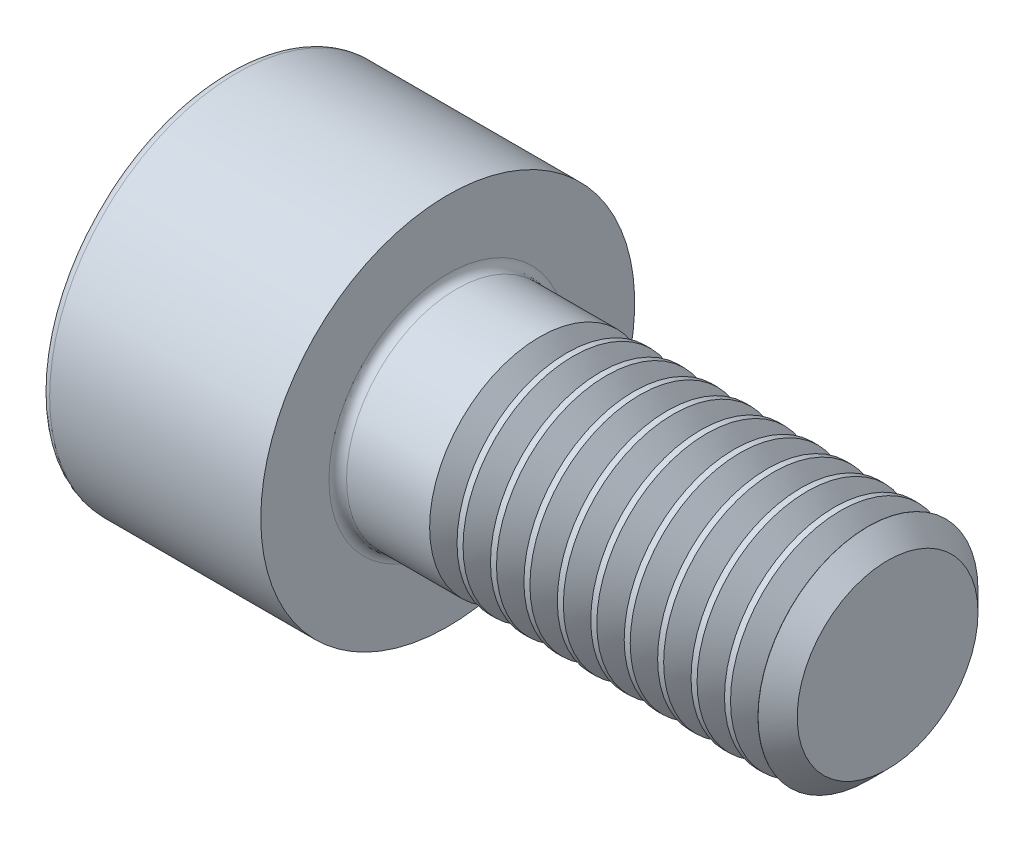
ISO-10303-21;
HEADER;
FILE_DESCRIPTION(('STEP AP214'),'2;1');
FILE_NAME('part.step','',(''),(''),'','','');
FILE_SCHEMA(('AUTOMOTIVE_DESIGN { 1 0 10303 214 1 1 1 1 }'));
ENDSEC;
DATA;
#1=APPLICATION_CONTEXT('core data for automotive mechanical design processes');
#2=APPLICATION_PROTOCOL_DEFINITION('international standard','automotive_design',2000,#1);
#3=PRODUCT_CONTEXT('',#1,'mechanical');
#4=PRODUCT('Part','Part','',(#3));
#5=PRODUCT_RELATED_PRODUCT_CATEGORY('part','',(#4));
#6=PRODUCT_DEFINITION_FORMATION('','',#4);
#7=PRODUCT_DEFINITION_CONTEXT('part definition',#1,'design');
#8=PRODUCT_DEFINITION('design','',#6,#7);
#9=PRODUCT_DEFINITION_SHAPE('','',#8);
#10=(LENGTH_UNIT() NAMED_UNIT(*) SI_UNIT(.MILLI.,.METRE.));
#11=(NAMED_UNIT(*) PLANE_ANGLE_UNIT() SI_UNIT($,.RADIAN.));
#12=(NAMED_UNIT(*) SI_UNIT($,.STERADIAN.) SOLID_ANGLE_UNIT());
#13=UNCERTAINTY_MEASURE_WITH_UNIT(LENGTH_MEASURE(1.E-05),#10,'distance_accuracy_value','');
#14=(GEOMETRIC_REPRESENTATION_CONTEXT(3) GLOBAL_UNCERTAINTY_ASSIGNED_CONTEXT((#13)) GLOBAL_UNIT_ASSIGNED_CONTEXT((#10,
#11,#12)) REPRESENTATION_CONTEXT('',''));
#15=CARTESIAN_POINT('',(0.,0.,0.));
#16=DIRECTION('',(0.,0.,1.));
#17=DIRECTION('',(1.,0.,0.));
#18=AXIS2_PLACEMENT_3D('',#15,#16,#17);
#19=CARTESIAN_POINT('',(-6.29059211403504,0.,0.));
#20=DIRECTION('',(-1.,0.,0.));
#21=DIRECTION('',(0.,0.,1.));
#22=AXIS2_PLACEMENT_3D('',#19,#20,#21);
#23=PLANE('',#22);
#24=DIRECTION('',(0.,-1.,0.));
#25=VECTOR('',#24,1.);
#26=CARTESIAN_POINT('',(-6.29059211403504,1.40976776438504,-2.042));
#27=LINE('',#26,#25);
#28=CARTESIAN_POINT('',(-6.29059211403504,1.40976776438504,-2.042));
#29=VERTEX_POINT('',#28);
#30=CARTESIAN_POINT('',(-6.29059211403504,0.230818514699828,-2.042));
#31=VERTEX_POINT('',#30);
#32=EDGE_CURVE('E652',#29,#31,#27,.T.);
#33=ORIENTED_EDGE('',*,*,#32,.T.);
#34=CARTESIAN_POINT('',(-6.29059211403504,0.23081851469983,0.));
#35=DIRECTION('',(1.,0.,0.));
#36=DIRECTION('',(0.,0.,-1.));
#37=AXIS2_PLACEMENT_3D('',#34,#35,#36);
#38=CIRCLE('',#37,2.042);
#39=CARTESIAN_POINT('',(-6.29059211403504,1.99924238922765,-1.021));
#40=VERTEX_POINT('',#39);
#41=EDGE_CURVE('E49',#31,#40,#38,.T.);
#42=ORIENTED_EDGE('',*,*,#41,.T.);
#43=DIRECTION('',(0.,-0.500000000000001,-0.866025403784438));
#44=VECTOR('',#43,1.);
#45=CARTESIAN_POINT('',(-6.29059211403504,2.58871701407026,0.));
#46=LINE('',#45,#44);
#47=EDGE_CURVE('E641',#40,#29,#46,.T.);
#48=ORIENTED_EDGE('',*,*,#47,.T.);
#49=EDGE_LOOP('',(#33,#42,#48));
#50=FACE_BOUND('',#49,.T.);
#51=ADVANCED_FACE('F34',(#50),#23,.T.);
#52=CARTESIAN_POINT('',(-6.29059211403504,2.58871701407026,0.));
#53=VERTEX_POINT('',#52);
#54=EDGE_CURVE('E644',#53,#40,#46,.T.);
#55=ORIENTED_EDGE('',*,*,#54,.T.);
#56=CARTESIAN_POINT('',(-6.29059211403504,1.99924238922766,1.021));
#57=VERTEX_POINT('',#56);
#58=EDGE_CURVE('E322',#40,#57,#38,.T.);
#59=ORIENTED_EDGE('',*,*,#58,.T.);
#60=DIRECTION('',(0.,0.499999999999998,-0.86602540378444));
#61=VECTOR('',#60,1.);
#62=CARTESIAN_POINT('',(-6.29059211403504,1.40976776438504,2.042));
#63=LINE('',#62,#61);
#64=EDGE_CURVE('E642',#57,#53,#63,.T.);
#65=ORIENTED_EDGE('',*,*,#64,.T.);
#66=EDGE_LOOP('',(#55,#59,#65));
#67=FACE_BOUND('',#66,.T.);
#68=ADVANCED_FACE('F122',(#67),#23,.T.);
#69=CARTESIAN_POINT('',(-6.29059211403504,1.40976776438504,2.042));
#70=VERTEX_POINT('',#69);
#71=EDGE_CURVE('E635',#70,#57,#63,.T.);
#72=ORIENTED_EDGE('',*,*,#71,.T.);
#73=CARTESIAN_POINT('',(-6.29059211403504,0.230818514699833,2.042));
#74=VERTEX_POINT('',#73);
#75=EDGE_CURVE('E636',#57,#74,#38,.T.);
#76=ORIENTED_EDGE('',*,*,#75,.T.);
#77=DIRECTION('',(0.,1.,0.));
#78=VECTOR('',#77,1.);
#79=CARTESIAN_POINT('',(-6.29059211403504,-0.948130734985386,2.042));
#80=LINE('',#79,#78);
#81=EDGE_CURVE('E638',#74,#70,#80,.T.);
#82=ORIENTED_EDGE('',*,*,#81,.T.);
#83=EDGE_LOOP('',(#72,#76,#82));
#84=FACE_BOUND('',#83,.T.);
#85=ADVANCED_FACE('F127',(#84),#23,.T.);
#86=CARTESIAN_POINT('',(-6.29059211403504,-0.948130734985386,2.042));
#87=VERTEX_POINT('',#86);
#88=EDGE_CURVE('E646',#87,#74,#80,.T.);
#89=ORIENTED_EDGE('',*,*,#88,.T.);
#90=CARTESIAN_POINT('',(-6.29059211403504,-1.53760535982799,1.021));
#91=VERTEX_POINT('',#90);
#92=EDGE_CURVE('E858',#74,#91,#38,.T.);
#93=ORIENTED_EDGE('',*,*,#92,.T.);
#94=DIRECTION('',(0.,0.500000000000001,0.866025403784438));
#95=VECTOR('',#94,1.);
#96=CARTESIAN_POINT('',(-6.29059211403504,-2.1270799846706,0.));
#97=LINE('',#96,#95);
#98=EDGE_CURVE('E850',#91,#87,#97,.T.);
#99=ORIENTED_EDGE('',*,*,#98,.T.);
#100=EDGE_LOOP('',(#89,#93,#99));
#101=FACE_BOUND('',#100,.T.);
#102=ADVANCED_FACE('F299',(#101),#23,.T.);
#103=CARTESIAN_POINT('',(-6.29059211403504,-2.1270799846706,0.));
#104=VERTEX_POINT('',#103);
#105=EDGE_CURVE('E842',#104,#91,#97,.T.);
#106=ORIENTED_EDGE('',*,*,#105,.T.);
#107=CARTESIAN_POINT('',(-6.29059211403504,-1.537605359828,-1.021));
#108=VERTEX_POINT('',#107);
#109=EDGE_CURVE('E312',#91,#108,#38,.T.);
#110=ORIENTED_EDGE('',*,*,#109,.T.);
#111=DIRECTION('',(0.,-0.499999999999998,0.86602540378444));
#112=VECTOR('',#111,1.);
#113=CARTESIAN_POINT('',(-6.29059211403504,-0.948130734985394,-2.042));
#114=LINE('',#113,#112);
#115=EDGE_CURVE('E671',#108,#104,#114,.T.);
#116=ORIENTED_EDGE('',*,*,#115,.T.);
#117=EDGE_LOOP('',(#106,#110,#116));
#118=FACE_BOUND('',#117,.T.);
#119=ADVANCED_FACE('F120',(#118),#23,.T.);
#120=CARTESIAN_POINT('',(-3.79059211403504,0.23081851469983,0.));
#121=DIRECTION('',(-1.,0.,0.));
#122=DIRECTION('',(0.,0.,1.));
#123=AXIS2_PLACEMENT_3D('',#120,#121,#122);
#124=CYLINDRICAL_SURFACE('',#123,4.25);
#125=CARTESIAN_POINT('',(-8.59059211403504,0.23081851469983,0.));
#126=DIRECTION('',(-1.,0.,0.));
#127=DIRECTION('',(0.,0.,1.));
#128=AXIS2_PLACEMENT_3D('',#125,#126,#127);
#129=CIRCLE('',#128,4.25);
#130=CARTESIAN_POINT('',(-8.59059211403504,0.23081851469983,4.25));
#131=VERTEX_POINT('',#130);
#132=EDGE_CURVE('E304',#131,#131,#129,.F.);
#133=ORIENTED_EDGE('',*,*,#132,.T.);
#134=EDGE_LOOP('',(#133));
#135=FACE_BOUND('',#134,.T.);
#136=CARTESIAN_POINT('',(-3.79059211403504,0.23081851469983,0.));
#137=DIRECTION('',(-1.,0.,0.));
#138=DIRECTION('',(0.,0.,1.));
#139=AXIS2_PLACEMENT_3D('',#136,#137,#138);
#140=CIRCLE('',#139,4.25);
#141=CARTESIAN_POINT('',(-3.79059211403504,0.23081851469983,4.25));
#142=VERTEX_POINT('',#141);
#143=EDGE_CURVE('E307',#142,#142,#140,.T.);
#144=ORIENTED_EDGE('',*,*,#143,.T.);
#145=EDGE_LOOP('',(#144));
#146=FACE_BOUND('',#145,.T.);
#147=ADVANCED_FACE('F292',(#135,#146),#124,.T.);
#148=CARTESIAN_POINT('',(-3.79059211403504,4.48081851469983,0.));
#149=DIRECTION('',(1.,0.,0.));
#150=DIRECTION('',(0.,0.,-1.));
#151=AXIS2_PLACEMENT_3D('',#148,#149,#150);
#152=PLANE('',#151);
#153=CARTESIAN_POINT('',(-3.79059211403504,0.23081851469983,0.));
#154=DIRECTION('',(1.,0.,0.));
#155=DIRECTION('',(0.,0.,-1.));
#156=AXIS2_PLACEMENT_3D('',#153,#154,#155);
#157=CIRCLE('',#156,2.7);
#158=CARTESIAN_POINT('',(-3.79059211403504,0.23081851469983,-2.7));
#159=VERTEX_POINT('',#158);
#160=EDGE_CURVE('E11',#159,#159,#157,.F.);
#161=ORIENTED_EDGE('',*,*,#160,.T.);
#162=EDGE_LOOP('',(#161));
#163=FACE_BOUND('',#162,.T.);
#164=ORIENTED_EDGE('',*,*,#143,.F.);
#165=EDGE_LOOP('',(#164));
#166=FACE_BOUND('',#165,.T.);
#167=ADVANCED_FACE('F288',(#163,#166),#152,.T.);
#168=CARTESIAN_POINT('',(-8.79059211403504,0.23081851469983,0.));
#169=DIRECTION('',(-1.,0.,0.));
#170=DIRECTION('',(0.,0.,1.));
#171=AXIS2_PLACEMENT_3D('',#168,#169,#170);
#172=PLANE('',#171);
#173=CARTESIAN_POINT('',(-8.79059211403504,0.23081851469983,0.));
#174=DIRECTION('',(-1.,0.,0.));
#175=DIRECTION('',(0.,0.,1.));
#176=AXIS2_PLACEMENT_3D('',#173,#174,#175);
#177=CIRCLE('',#176,4.05);
#178=CARTESIAN_POINT('',(-8.79059211403504,0.23081851469983,4.05));
#179=VERTEX_POINT('',#178);
#180=EDGE_CURVE('E319',#179,#179,#177,.T.);
#181=ORIENTED_EDGE('',*,*,#180,.T.);
#182=EDGE_LOOP('',(#181));
#183=FACE_BOUND('',#182,.T.);
#184=DIRECTION('',(0.,-0.499999999999998,0.86602540378444));
#185=VECTOR('',#184,1.);
#186=CARTESIAN_POINT('',(-8.79059211403504,-0.948130734985394,-2.042));
#187=LINE('',#186,#185);
#188=CARTESIAN_POINT('',(-8.79059211403504,-0.948130734985394,-2.042));
#189=VERTEX_POINT('',#188);
#190=CARTESIAN_POINT('',(-8.79059211403504,-2.1270799846706,0.));
#191=VERTEX_POINT('',#190);
#192=EDGE_CURVE('E57',#189,#191,#187,.T.);
#193=ORIENTED_EDGE('',*,*,#192,.F.);
#194=DIRECTION('',(0.,-1.,0.));
#195=VECTOR('',#194,1.);
#196=CARTESIAN_POINT('',(-8.79059211403504,1.40976776438504,-2.042));
#197=LINE('',#196,#195);
#198=CARTESIAN_POINT('',(-8.79059211403504,1.40976776438504,-2.042));
#199=VERTEX_POINT('',#198);
#200=EDGE_CURVE('E668',#199,#189,#197,.T.);
#201=ORIENTED_EDGE('',*,*,#200,.F.);
#202=DIRECTION('',(0.,-0.500000000000001,-0.866025403784438));
#203=VECTOR('',#202,1.);
#204=CARTESIAN_POINT('',(-8.79059211403504,2.58871701407026,0.));
#205=LINE('',#204,#203);
#206=CARTESIAN_POINT('',(-8.79059211403504,2.58871701407026,0.));
#207=VERTEX_POINT('',#206);
#208=EDGE_CURVE('E665',#207,#199,#205,.T.);
#209=ORIENTED_EDGE('',*,*,#208,.F.);
#210=DIRECTION('',(0.,0.499999999999998,-0.86602540378444));
#211=VECTOR('',#210,1.);
#212=CARTESIAN_POINT('',(-8.79059211403504,1.40976776438504,2.042));
#213=LINE('',#212,#211);
#214=CARTESIAN_POINT('',(-8.79059211403504,1.40976776438504,2.042));
#215=VERTEX_POINT('',#214);
#216=EDGE_CURVE('E662',#215,#207,#213,.T.);
#217=ORIENTED_EDGE('',*,*,#216,.F.);
#218=DIRECTION('',(0.,1.,0.));
#219=VECTOR('',#218,1.);
#220=CARTESIAN_POINT('',(-8.79059211403504,-0.948130734985386,2.042));
#221=LINE('',#220,#219);
#222=CARTESIAN_POINT('',(-8.79059211403504,-0.948130734985386,2.042));
#223=VERTEX_POINT('',#222);
#224=EDGE_CURVE('E659',#223,#215,#221,.T.);
#225=ORIENTED_EDGE('',*,*,#224,.F.);
#226=DIRECTION('',(0.,0.500000000000001,0.866025403784438));
#227=VECTOR('',#226,1.);
#228=CARTESIAN_POINT('',(-8.79059211403504,-2.1270799846706,0.));
#229=LINE('',#228,#227);
#230=EDGE_CURVE('E656',#191,#223,#229,.T.);
#231=ORIENTED_EDGE('',*,*,#230,.F.);
#232=EDGE_LOOP('',(#193,#201,#209,#217,#225,#231));
#233=FACE_BOUND('',#232,.T.);
#234=ADVANCED_FACE('F284',(#183,#233),#172,.T.);
#235=CARTESIAN_POINT('',(-1.70218446853837,0.23081851469983,0.));
#236=DIRECTION('',(-1.,0.,0.));
#237=DIRECTION('',(0.,0.,1.));
#238=AXIS2_PLACEMENT_3D('',#235,#236,#237);
#239=CYLINDRICAL_SURFACE('',#238,2.5);
#240=CARTESIAN_POINT('',(-3.59059211403504,0.23081851469983,0.));
#241=DIRECTION('',(1.,0.,0.));
#242=DIRECTION('',(0.,0.,-1.));
#243=AXIS2_PLACEMENT_3D('',#240,#241,#242);
#244=CIRCLE('',#243,2.5);
#245=CARTESIAN_POINT('',(-3.59059211403504,0.23081851469983,-2.5));
#246=VERTEX_POINT('',#245);
#247=EDGE_CURVE('E42',#246,#246,#244,.T.);
#248=ORIENTED_EDGE('',*,*,#247,.T.);
#249=EDGE_LOOP('',(#248));
#250=FACE_BOUND('',#249,.T.);
#251=CARTESIAN_POINT('',(-1.70218446853837,0.23081851469983,0.));
#252=DIRECTION('',(1.,0.,0.));
#253=DIRECTION('',(0.,0.,-1.));
#254=AXIS2_PLACEMENT_3D('',#251,#252,#253);
#255=CIRCLE('',#254,2.5);
#256=CARTESIAN_POINT('',(-1.70218446853837,0.23081851469983,-2.5));
#257=VERTEX_POINT('',#256);
#258=EDGE_CURVE('E310',#257,#257,#255,.T.);
#259=ORIENTED_EDGE('',*,*,#258,.F.);
#260=EDGE_LOOP('',(#259));
#261=FACE_BOUND('',#260,.T.);
#262=ADVANCED_FACE('F280',(#250,#261),#239,.T.);
#263=CARTESIAN_POINT('',(-1.70218446853837,0.230818514699832,0.));
#264=DIRECTION('',(-1.,0.,0.));
#265=DIRECTION('',(0.,0.,-1.));
#266=AXIS2_PLACEMENT_3D('',#263,#264,#265);
#267=CONICAL_SURFACE('',#266,2.5,0.959931088596872);
#268=CARTESIAN_POINT('',(-1.39059211403504,0.230818514699832,0.));
#269=DIRECTION('',(1.,0.,0.));
#270=DIRECTION('',(0.,0.,-1.));
#271=AXIS2_PLACEMENT_3D('',#268,#269,#270);
#272=CIRCLE('',#271,2.055);
#273=CARTESIAN_POINT('',(-1.39059211403504,0.230818514699832,-2.055));
#274=VERTEX_POINT('',#273);
#275=EDGE_CURVE('E315',#274,#274,#272,.T.);
#276=ORIENTED_EDGE('',*,*,#275,.F.);
#277=EDGE_LOOP('',(#276));
#278=FACE_BOUND('',#277,.T.);
#279=ORIENTED_EDGE('',*,*,#258,.T.);
#280=EDGE_LOOP('',(#279));
#281=FACE_BOUND('',#280,.T.);
#282=ADVANCED_FACE('F276',(#278,#281),#267,.T.);
#283=CARTESIAN_POINT('',(-1.39059211403504,0.230818514699832,0.));
#284=DIRECTION('',(1.,0.,0.));
#285=DIRECTION('',(0.,0.,-1.));
#286=AXIS2_PLACEMENT_3D('',#283,#284,#285);
#287=CONICAL_SURFACE('',#286,2.055,0.959931088596886);
#288=CARTESIAN_POINT('',(-1.07899975953172,0.230818514699832,0.));
#289=DIRECTION('',(1.,0.,0.));
#290=DIRECTION('',(0.,0.,-1.));
#291=AXIS2_PLACEMENT_3D('',#288,#289,#290);
#292=CIRCLE('',#291,2.5);
#293=CARTESIAN_POINT('',(-1.07899975953172,0.230818514699832,-2.5));
#294=VERTEX_POINT('',#293);
#295=EDGE_CURVE('E770',#294,#294,#292,.T.);
#296=ORIENTED_EDGE('',*,*,#295,.F.);
#297=EDGE_LOOP('',(#296));
#298=FACE_BOUND('',#297,.T.);
#299=ORIENTED_EDGE('',*,*,#275,.T.);
#300=EDGE_LOOP('',(#299));
#301=FACE_BOUND('',#300,.T.);
#302=ADVANCED_FACE('F272',(#298,#301),#287,.T.);
#303=CARTESIAN_POINT('',(-0.942184468538365,0.23081851469983,0.));
#304=DIRECTION('',(-1.,0.,0.));
#305=DIRECTION('',(0.,0.,1.));
#306=AXIS2_PLACEMENT_3D('',#303,#304,#305);
#307=CYLINDRICAL_SURFACE('',#306,2.5);
#308=CARTESIAN_POINT('',(-0.942184468538365,0.23081851469983,0.));
#309=DIRECTION('',(1.,0.,0.));
#310=DIRECTION('',(0.,0.,-1.));
#311=AXIS2_PLACEMENT_3D('',#308,#309,#310);
#312=CIRCLE('',#311,2.5);
#313=CARTESIAN_POINT('',(-0.942184468538365,0.23081851469983,-2.5));
#314=VERTEX_POINT('',#313);
#315=EDGE_CURVE('E767',#314,#314,#312,.T.);
#316=ORIENTED_EDGE('',*,*,#315,.F.);
#317=EDGE_LOOP('',(#316));
#318=FACE_BOUND('',#317,.T.);
#319=ORIENTED_EDGE('',*,*,#295,.T.);
#320=EDGE_LOOP('',(#319));
#321=FACE_BOUND('',#320,.T.);
#322=ADVANCED_FACE('F268',(#318,#321),#307,.T.);
#323=CARTESIAN_POINT('',(-0.942184468538365,0.230818514699832,0.));
#324=DIRECTION('',(-1.,0.,0.));
#325=DIRECTION('',(0.,0.,-1.));
#326=AXIS2_PLACEMENT_3D('',#323,#324,#325);
#327=CONICAL_SURFACE('',#326,2.5,0.959931088596871);
#328=CARTESIAN_POINT('',(-0.630592114035039,0.230818514699832,0.));
#329=DIRECTION('',(1.,0.,0.));
#330=DIRECTION('',(0.,0.,-1.));
#331=AXIS2_PLACEMENT_3D('',#328,#329,#330);
#332=CIRCLE('',#331,2.055);
#333=CARTESIAN_POINT('',(-0.630592114035039,0.230818514699832,-2.055));
#334=VERTEX_POINT('',#333);
#335=EDGE_CURVE('E764',#334,#334,#332,.T.);
#336=ORIENTED_EDGE('',*,*,#335,.F.);
#337=EDGE_LOOP('',(#336));
#338=FACE_BOUND('',#337,.T.);
#339=ORIENTED_EDGE('',*,*,#315,.T.);
#340=EDGE_LOOP('',(#339));
#341=FACE_BOUND('',#340,.T.);
#342=ADVANCED_FACE('F264',(#338,#341),#327,.T.);
#343=CARTESIAN_POINT('',(-0.630592114035039,0.230818514699832,0.));
#344=DIRECTION('',(1.,0.,0.));
#345=DIRECTION('',(0.,0.,-1.));
#346=AXIS2_PLACEMENT_3D('',#343,#344,#345);
#347=CONICAL_SURFACE('',#346,2.055,0.959931088596886);
#348=CARTESIAN_POINT('',(-0.318999759531719,0.230818514699832,0.));
#349=DIRECTION('',(1.,0.,0.));
#350=DIRECTION('',(0.,0.,-1.));
#351=AXIS2_PLACEMENT_3D('',#348,#349,#350);
#352=CIRCLE('',#351,2.5);
#353=CARTESIAN_POINT('',(-0.318999759531719,0.230818514699832,-2.5));
#354=VERTEX_POINT('',#353);
#355=EDGE_CURVE('E761',#354,#354,#352,.T.);
#356=ORIENTED_EDGE('',*,*,#355,.F.);
#357=EDGE_LOOP('',(#356));
#358=FACE_BOUND('',#357,.T.);
#359=ORIENTED_EDGE('',*,*,#335,.T.);
#360=EDGE_LOOP('',(#359));
#361=FACE_BOUND('',#360,.T.);
#362=ADVANCED_FACE('F260',(#358,#361),#347,.T.);
#363=CARTESIAN_POINT('',(-0.182184468538365,0.23081851469983,0.));
#364=DIRECTION('',(-1.,0.,0.));
#365=DIRECTION('',(0.,0.,1.));
#366=AXIS2_PLACEMENT_3D('',#363,#364,#365);
#367=CYLINDRICAL_SURFACE('',#366,2.5);
#368=CARTESIAN_POINT('',(-0.182184468538365,0.23081851469983,0.));
#369=DIRECTION('',(1.,0.,0.));
#370=DIRECTION('',(0.,0.,-1.));
#371=AXIS2_PLACEMENT_3D('',#368,#369,#370);
#372=CIRCLE('',#371,2.5);
#373=CARTESIAN_POINT('',(-0.182184468538365,0.23081851469983,-2.5));
#374=VERTEX_POINT('',#373);
#375=EDGE_CURVE('E758',#374,#374,#372,.T.);
#376=ORIENTED_EDGE('',*,*,#375,.F.);
#377=EDGE_LOOP('',(#376));
#378=FACE_BOUND('',#377,.T.);
#379=ORIENTED_EDGE('',*,*,#355,.T.);
#380=EDGE_LOOP('',(#379));
#381=FACE_BOUND('',#380,.T.);
#382=ADVANCED_FACE('F256',(#378,#381),#367,.T.);
#383=CARTESIAN_POINT('',(-0.182184468538365,0.230818514699832,0.));
#384=DIRECTION('',(-1.,0.,0.));
#385=DIRECTION('',(0.,0.,-1.));
#386=AXIS2_PLACEMENT_3D('',#383,#384,#385);
#387=CONICAL_SURFACE('',#386,2.5,0.959931088596871);
#388=CARTESIAN_POINT('',(0.129407885964961,0.230818514699832,0.));
#389=DIRECTION('',(1.,0.,0.));
#390=DIRECTION('',(0.,0.,-1.));
#391=AXIS2_PLACEMENT_3D('',#388,#389,#390);
#392=CIRCLE('',#391,2.055);
#393=CARTESIAN_POINT('',(0.129407885964961,0.230818514699832,-2.055));
#394=VERTEX_POINT('',#393);
#395=EDGE_CURVE('E755',#394,#394,#392,.T.);
#396=ORIENTED_EDGE('',*,*,#395,.F.);
#397=EDGE_LOOP('',(#396));
#398=FACE_BOUND('',#397,.T.);
#399=ORIENTED_EDGE('',*,*,#375,.T.);
#400=EDGE_LOOP('',(#399));
#401=FACE_BOUND('',#400,.T.);
#402=ADVANCED_FACE('F252',(#398,#401),#387,.T.);
#403=CARTESIAN_POINT('',(0.129407885964961,0.230818514699832,0.));
#404=DIRECTION('',(1.,0.,0.));
#405=DIRECTION('',(0.,0.,-1.));
#406=AXIS2_PLACEMENT_3D('',#403,#404,#405);
#407=CONICAL_SURFACE('',#406,2.055,0.959931088596886);
#408=CARTESIAN_POINT('',(0.441000240468281,0.230818514699832,0.));
#409=DIRECTION('',(1.,0.,0.));
#410=DIRECTION('',(0.,0.,-1.));
#411=AXIS2_PLACEMENT_3D('',#408,#409,#410);
#412=CIRCLE('',#411,2.5);
#413=CARTESIAN_POINT('',(0.441000240468281,0.230818514699832,-2.5));
#414=VERTEX_POINT('',#413);
#415=EDGE_CURVE('E752',#414,#414,#412,.T.);
#416=ORIENTED_EDGE('',*,*,#415,.F.);
#417=EDGE_LOOP('',(#416));
#418=FACE_BOUND('',#417,.T.);
#419=ORIENTED_EDGE('',*,*,#395,.T.);
#420=EDGE_LOOP('',(#419));
#421=FACE_BOUND('',#420,.T.);
#422=ADVANCED_FACE('F248',(#418,#421),#407,.T.);
#423=CARTESIAN_POINT('',(0.577815531461636,0.23081851469983,0.));
#424=DIRECTION('',(-1.,0.,0.));
#425=DIRECTION('',(0.,0.,1.));
#426=AXIS2_PLACEMENT_3D('',#423,#424,#425);
#427=CYLINDRICAL_SURFACE('',#426,2.5);
#428=CARTESIAN_POINT('',(0.577815531461636,0.23081851469983,0.));
#429=DIRECTION('',(1.,0.,0.));
#430=DIRECTION('',(0.,0.,-1.));
#431=AXIS2_PLACEMENT_3D('',#428,#429,#430);
#432=CIRCLE('',#431,2.5);
#433=CARTESIAN_POINT('',(0.577815531461636,0.23081851469983,-2.5));
#434=VERTEX_POINT('',#433);
#435=EDGE_CURVE('E749',#434,#434,#432,.T.);
#436=ORIENTED_EDGE('',*,*,#435,.F.);
#437=EDGE_LOOP('',(#436));
#438=FACE_BOUND('',#437,.T.);
#439=ORIENTED_EDGE('',*,*,#415,.T.);
#440=EDGE_LOOP('',(#439));
#441=FACE_BOUND('',#440,.T.);
#442=ADVANCED_FACE('F244',(#438,#441),#427,.T.);
#443=CARTESIAN_POINT('',(0.577815531461636,0.230818514699832,0.));
#444=DIRECTION('',(-1.,0.,0.));
#445=DIRECTION('',(0.,0.,-1.));
#446=AXIS2_PLACEMENT_3D('',#443,#444,#445);
#447=CONICAL_SURFACE('',#446,2.5,0.959931088596871);
#448=CARTESIAN_POINT('',(0.889407885964961,0.230818514699832,0.));
#449=DIRECTION('',(1.,0.,0.));
#450=DIRECTION('',(0.,0.,-1.));
#451=AXIS2_PLACEMENT_3D('',#448,#449,#450);
#452=CIRCLE('',#451,2.055);
#453=CARTESIAN_POINT('',(0.889407885964961,0.230818514699832,-2.055));
#454=VERTEX_POINT('',#453);
#455=EDGE_CURVE('E746',#454,#454,#452,.T.);
#456=ORIENTED_EDGE('',*,*,#455,.F.);
#457=EDGE_LOOP('',(#456));
#458=FACE_BOUND('',#457,.T.);
#459=ORIENTED_EDGE('',*,*,#435,.T.);
#460=EDGE_LOOP('',(#459));
#461=FACE_BOUND('',#460,.T.);
#462=ADVANCED_FACE('F240',(#458,#461),#447,.T.);
#463=CARTESIAN_POINT('',(0.889407885964961,0.230818514699832,0.));
#464=DIRECTION('',(1.,0.,0.));
#465=DIRECTION('',(0.,0.,-1.));
#466=AXIS2_PLACEMENT_3D('',#463,#464,#465);
#467=CONICAL_SURFACE('',#466,2.055,0.959931088596886);
#468=CARTESIAN_POINT('',(1.20100024046828,0.230818514699832,0.));
#469=DIRECTION('',(1.,0.,0.));
#470=DIRECTION('',(0.,0.,-1.));
#471=AXIS2_PLACEMENT_3D('',#468,#469,#470);
#472=CIRCLE('',#471,2.5);
#473=CARTESIAN_POINT('',(1.20100024046828,0.230818514699832,-2.5));
#474=VERTEX_POINT('',#473);
#475=EDGE_CURVE('E743',#474,#474,#472,.T.);
#476=ORIENTED_EDGE('',*,*,#475,.F.);
#477=EDGE_LOOP('',(#476));
#478=FACE_BOUND('',#477,.T.);
#479=ORIENTED_EDGE('',*,*,#455,.T.);
#480=EDGE_LOOP('',(#479));
#481=FACE_BOUND('',#480,.T.);
#482=ADVANCED_FACE('F236',(#478,#481),#467,.T.);
#483=CARTESIAN_POINT('',(1.33781553146164,0.23081851469983,0.));
#484=DIRECTION('',(-1.,0.,0.));
#485=DIRECTION('',(0.,0.,1.));
#486=AXIS2_PLACEMENT_3D('',#483,#484,#485);
#487=CYLINDRICAL_SURFACE('',#486,2.5);
#488=CARTESIAN_POINT('',(1.33781553146164,0.23081851469983,0.));
#489=DIRECTION('',(1.,0.,0.));
#490=DIRECTION('',(0.,0.,-1.));
#491=AXIS2_PLACEMENT_3D('',#488,#489,#490);
#492=CIRCLE('',#491,2.5);
#493=CARTESIAN_POINT('',(1.33781553146164,0.23081851469983,-2.5));
#494=VERTEX_POINT('',#493);
#495=EDGE_CURVE('E740',#494,#494,#492,.T.);
#496=ORIENTED_EDGE('',*,*,#495,.F.);
#497=EDGE_LOOP('',(#496));
#498=FACE_BOUND('',#497,.T.);
#499=ORIENTED_EDGE('',*,*,#475,.T.);
#500=EDGE_LOOP('',(#499));
#501=FACE_BOUND('',#500,.T.);
#502=ADVANCED_FACE('F232',(#498,#501),#487,.T.);
#503=CARTESIAN_POINT('',(1.33781553146164,0.230818514699832,0.));
#504=DIRECTION('',(-1.,0.,0.));
#505=DIRECTION('',(0.,0.,-1.));
#506=AXIS2_PLACEMENT_3D('',#503,#504,#505);
#507=CONICAL_SURFACE('',#506,2.5,0.959931088596872);
#508=CARTESIAN_POINT('',(1.64940788596496,0.230818514699832,0.));
#509=DIRECTION('',(1.,0.,0.));
#510=DIRECTION('',(0.,0.,-1.));
#511=AXIS2_PLACEMENT_3D('',#508,#509,#510);
#512=CIRCLE('',#511,2.055);
#513=CARTESIAN_POINT('',(1.64940788596496,0.230818514699832,-2.055));
#514=VERTEX_POINT('',#513);
#515=EDGE_CURVE('E737',#514,#514,#512,.T.);
#516=ORIENTED_EDGE('',*,*,#515,.F.);
#517=EDGE_LOOP('',(#516));
#518=FACE_BOUND('',#517,.T.);
#519=ORIENTED_EDGE('',*,*,#495,.T.);
#520=EDGE_LOOP('',(#519));
#521=FACE_BOUND('',#520,.T.);
#522=ADVANCED_FACE('F228',(#518,#521),#507,.T.);
#523=CARTESIAN_POINT('',(1.64940788596496,0.230818514699832,0.));
#524=DIRECTION('',(1.,0.,0.));
#525=DIRECTION('',(0.,0.,-1.));
#526=AXIS2_PLACEMENT_3D('',#523,#524,#525);
#527=CONICAL_SURFACE('',#526,2.055,0.959931088596886);
#528=CARTESIAN_POINT('',(1.96100024046828,0.230818514699832,0.));
#529=DIRECTION('',(1.,0.,0.));
#530=DIRECTION('',(0.,0.,-1.));
#531=AXIS2_PLACEMENT_3D('',#528,#529,#530);
#532=CIRCLE('',#531,2.5);
#533=CARTESIAN_POINT('',(1.96100024046828,0.230818514699832,-2.5));
#534=VERTEX_POINT('',#533);
#535=EDGE_CURVE('E734',#534,#534,#532,.T.);
#536=ORIENTED_EDGE('',*,*,#535,.F.);
#537=EDGE_LOOP('',(#536));
#538=FACE_BOUND('',#537,.T.);
#539=ORIENTED_EDGE('',*,*,#515,.T.);
#540=EDGE_LOOP('',(#539));
#541=FACE_BOUND('',#540,.T.);
#542=ADVANCED_FACE('F224',(#538,#541),#527,.T.);
#543=CARTESIAN_POINT('',(2.09781553146164,0.23081851469983,0.));
#544=DIRECTION('',(-1.,0.,0.));
#545=DIRECTION('',(0.,0.,1.));
#546=AXIS2_PLACEMENT_3D('',#543,#544,#545);
#547=CYLINDRICAL_SURFACE('',#546,2.5);
#548=CARTESIAN_POINT('',(2.09781553146164,0.23081851469983,0.));
#549=DIRECTION('',(1.,0.,0.));
#550=DIRECTION('',(0.,0.,-1.));
#551=AXIS2_PLACEMENT_3D('',#548,#549,#550);
#552=CIRCLE('',#551,2.5);
#553=CARTESIAN_POINT('',(2.09781553146164,0.23081851469983,-2.5));
#554=VERTEX_POINT('',#553);
#555=EDGE_CURVE('E731',#554,#554,#552,.T.);
#556=ORIENTED_EDGE('',*,*,#555,.F.);
#557=EDGE_LOOP('',(#556));
#558=FACE_BOUND('',#557,.T.);
#559=ORIENTED_EDGE('',*,*,#535,.T.);
#560=EDGE_LOOP('',(#559));
#561=FACE_BOUND('',#560,.T.);
#562=ADVANCED_FACE('F220',(#558,#561),#547,.T.);
#563=CARTESIAN_POINT('',(2.09781553146164,0.230818514699832,0.));
#564=DIRECTION('',(-1.,0.,0.));
#565=DIRECTION('',(0.,0.,-1.));
#566=AXIS2_PLACEMENT_3D('',#563,#564,#565);
#567=CONICAL_SURFACE('',#566,2.5,0.959931088596871);
#568=CARTESIAN_POINT('',(2.40940788596496,0.230818514699832,0.));
#569=DIRECTION('',(1.,0.,0.));
#570=DIRECTION('',(0.,0.,-1.));
#571=AXIS2_PLACEMENT_3D('',#568,#569,#570);
#572=CIRCLE('',#571,2.055);
#573=CARTESIAN_POINT('',(2.40940788596496,0.230818514699832,-2.055));
#574=VERTEX_POINT('',#573);
#575=EDGE_CURVE('E728',#574,#574,#572,.T.);
#576=ORIENTED_EDGE('',*,*,#575,.F.);
#577=EDGE_LOOP('',(#576));
#578=FACE_BOUND('',#577,.T.);
#579=ORIENTED_EDGE('',*,*,#555,.T.);
#580=EDGE_LOOP('',(#579));
#581=FACE_BOUND('',#580,.T.);
#582=ADVANCED_FACE('F216',(#578,#581),#567,.T.);
#583=CARTESIAN_POINT('',(2.40940788596496,0.230818514699832,0.));
#584=DIRECTION('',(1.,0.,0.));
#585=DIRECTION('',(0.,0.,-1.));
#586=AXIS2_PLACEMENT_3D('',#583,#584,#585);
#587=CONICAL_SURFACE('',#586,2.055,0.959931088596886);
#588=CARTESIAN_POINT('',(2.72100024046828,0.230818514699832,0.));
#589=DIRECTION('',(1.,0.,0.));
#590=DIRECTION('',(0.,0.,-1.));
#591=AXIS2_PLACEMENT_3D('',#588,#589,#590);
#592=CIRCLE('',#591,2.5);
#593=CARTESIAN_POINT('',(2.72100024046828,0.230818514699832,-2.5));
#594=VERTEX_POINT('',#593);
#595=EDGE_CURVE('E725',#594,#594,#592,.T.);
#596=ORIENTED_EDGE('',*,*,#595,.F.);
#597=EDGE_LOOP('',(#596));
#598=FACE_BOUND('',#597,.T.);
#599=ORIENTED_EDGE('',*,*,#575,.T.);
#600=EDGE_LOOP('',(#599));
#601=FACE_BOUND('',#600,.T.);
#602=ADVANCED_FACE('F212',(#598,#601),#587,.T.);
#603=CARTESIAN_POINT('',(2.85781553146163,0.23081851469983,0.));
#604=DIRECTION('',(-1.,0.,0.));
#605=DIRECTION('',(0.,0.,1.));
#606=AXIS2_PLACEMENT_3D('',#603,#604,#605);
#607=CYLINDRICAL_SURFACE('',#606,2.5);
#608=CARTESIAN_POINT('',(2.85781553146163,0.23081851469983,0.));
#609=DIRECTION('',(1.,0.,0.));
#610=DIRECTION('',(0.,0.,-1.));
#611=AXIS2_PLACEMENT_3D('',#608,#609,#610);
#612=CIRCLE('',#611,2.5);
#613=CARTESIAN_POINT('',(2.85781553146163,0.23081851469983,-2.5));
#614=VERTEX_POINT('',#613);
#615=EDGE_CURVE('E722',#614,#614,#612,.T.);
#616=ORIENTED_EDGE('',*,*,#615,.F.);
#617=EDGE_LOOP('',(#616));
#618=FACE_BOUND('',#617,.T.);
#619=ORIENTED_EDGE('',*,*,#595,.T.);
#620=EDGE_LOOP('',(#619));
#621=FACE_BOUND('',#620,.T.);
#622=ADVANCED_FACE('F208',(#618,#621),#607,.T.);
#623=CARTESIAN_POINT('',(2.85781553146163,0.230818514699832,0.));
#624=DIRECTION('',(-1.,0.,0.));
#625=DIRECTION('',(0.,0.,-1.));
#626=AXIS2_PLACEMENT_3D('',#623,#624,#625);
#627=CONICAL_SURFACE('',#626,2.5,0.959931088596871);
#628=CARTESIAN_POINT('',(3.16940788596496,0.230818514699832,0.));
#629=DIRECTION('',(1.,0.,0.));
#630=DIRECTION('',(0.,0.,-1.));
#631=AXIS2_PLACEMENT_3D('',#628,#629,#630);
#632=CIRCLE('',#631,2.055);
#633=CARTESIAN_POINT('',(3.16940788596496,0.230818514699832,-2.055));
#634=VERTEX_POINT('',#633);
#635=EDGE_CURVE('E719',#634,#634,#632,.T.);
#636=ORIENTED_EDGE('',*,*,#635,.F.);
#637=EDGE_LOOP('',(#636));
#638=FACE_BOUND('',#637,.T.);
#639=ORIENTED_EDGE('',*,*,#615,.T.);
#640=EDGE_LOOP('',(#639));
#641=FACE_BOUND('',#640,.T.);
#642=ADVANCED_FACE('F204',(#638,#641),#627,.T.);
#643=CARTESIAN_POINT('',(3.16940788596496,0.230818514699832,0.));
#644=DIRECTION('',(1.,0.,0.));
#645=DIRECTION('',(0.,0.,-1.));
#646=AXIS2_PLACEMENT_3D('',#643,#644,#645);
#647=CONICAL_SURFACE('',#646,2.055,0.959931088596886);
#648=CARTESIAN_POINT('',(3.48100024046828,0.230818514699832,0.));
#649=DIRECTION('',(1.,0.,0.));
#650=DIRECTION('',(0.,0.,-1.));
#651=AXIS2_PLACEMENT_3D('',#648,#649,#650);
#652=CIRCLE('',#651,2.5);
#653=CARTESIAN_POINT('',(3.48100024046828,0.230818514699832,-2.5));
#654=VERTEX_POINT('',#653);
#655=EDGE_CURVE('E716',#654,#654,#652,.T.);
#656=ORIENTED_EDGE('',*,*,#655,.F.);
#657=EDGE_LOOP('',(#656));
#658=FACE_BOUND('',#657,.T.);
#659=ORIENTED_EDGE('',*,*,#635,.T.);
#660=EDGE_LOOP('',(#659));
#661=FACE_BOUND('',#660,.T.);
#662=ADVANCED_FACE('F200',(#658,#661),#647,.T.);
#663=CARTESIAN_POINT('',(3.61781553146163,0.23081851469983,0.));
#664=DIRECTION('',(-1.,0.,0.));
#665=DIRECTION('',(0.,0.,1.));
#666=AXIS2_PLACEMENT_3D('',#663,#664,#665);
#667=CYLINDRICAL_SURFACE('',#666,2.5);
#668=CARTESIAN_POINT('',(3.61781553146163,0.23081851469983,0.));
#669=DIRECTION('',(1.,0.,0.));
#670=DIRECTION('',(0.,0.,-1.));
#671=AXIS2_PLACEMENT_3D('',#668,#669,#670);
#672=CIRCLE('',#671,2.5);
#673=CARTESIAN_POINT('',(3.61781553146163,0.23081851469983,-2.5));
#674=VERTEX_POINT('',#673);
#675=EDGE_CURVE('E713',#674,#674,#672,.T.);
#676=ORIENTED_EDGE('',*,*,#675,.F.);
#677=EDGE_LOOP('',(#676));
#678=FACE_BOUND('',#677,.T.);
#679=ORIENTED_EDGE('',*,*,#655,.T.);
#680=EDGE_LOOP('',(#679));
#681=FACE_BOUND('',#680,.T.);
#682=ADVANCED_FACE('F196',(#678,#681),#667,.T.);
#683=CARTESIAN_POINT('',(3.61781553146163,0.230818514699832,0.));
#684=DIRECTION('',(-1.,0.,0.));
#685=DIRECTION('',(0.,0.,-1.));
#686=AXIS2_PLACEMENT_3D('',#683,#684,#685);
#687=CONICAL_SURFACE('',#686,2.5,0.959931088596871);
#688=CARTESIAN_POINT('',(3.92940788596496,0.230818514699832,0.));
#689=DIRECTION('',(1.,0.,0.));
#690=DIRECTION('',(0.,0.,-1.));
#691=AXIS2_PLACEMENT_3D('',#688,#689,#690);
#692=CIRCLE('',#691,2.055);
#693=CARTESIAN_POINT('',(3.92940788596496,0.230818514699832,-2.055));
#694=VERTEX_POINT('',#693);
#695=EDGE_CURVE('E710',#694,#694,#692,.T.);
#696=ORIENTED_EDGE('',*,*,#695,.F.);
#697=EDGE_LOOP('',(#696));
#698=FACE_BOUND('',#697,.T.);
#699=ORIENTED_EDGE('',*,*,#675,.T.);
#700=EDGE_LOOP('',(#699));
#701=FACE_BOUND('',#700,.T.);
#702=ADVANCED_FACE('F192',(#698,#701),#687,.T.);
#703=CARTESIAN_POINT('',(3.92940788596496,0.230818514699832,0.));
#704=DIRECTION('',(1.,0.,0.));
#705=DIRECTION('',(0.,0.,-1.));
#706=AXIS2_PLACEMENT_3D('',#703,#704,#705);
#707=CONICAL_SURFACE('',#706,2.055,0.959931088596886);
#708=CARTESIAN_POINT('',(4.24100024046828,0.230818514699832,0.));
#709=DIRECTION('',(1.,0.,0.));
#710=DIRECTION('',(0.,0.,-1.));
#711=AXIS2_PLACEMENT_3D('',#708,#709,#710);
#712=CIRCLE('',#711,2.5);
#713=CARTESIAN_POINT('',(4.24100024046828,0.230818514699832,-2.50000000000001));
#714=VERTEX_POINT('',#713);
#715=EDGE_CURVE('E707',#714,#714,#712,.T.);
#716=ORIENTED_EDGE('',*,*,#715,.F.);
#717=EDGE_LOOP('',(#716));
#718=FACE_BOUND('',#717,.T.);
#719=ORIENTED_EDGE('',*,*,#695,.T.);
#720=EDGE_LOOP('',(#719));
#721=FACE_BOUND('',#720,.T.);
#722=ADVANCED_FACE('F188',(#718,#721),#707,.T.);
#723=CARTESIAN_POINT('',(4.37781553146164,0.23081851469983,0.));
#724=DIRECTION('',(-1.,0.,0.));
#725=DIRECTION('',(0.,0.,1.));
#726=AXIS2_PLACEMENT_3D('',#723,#724,#725);
#727=CYLINDRICAL_SURFACE('',#726,2.5);
#728=CARTESIAN_POINT('',(4.37781553146164,0.23081851469983,0.));
#729=DIRECTION('',(1.,0.,0.));
#730=DIRECTION('',(0.,0.,-1.));
#731=AXIS2_PLACEMENT_3D('',#728,#729,#730);
#732=CIRCLE('',#731,2.5);
#733=CARTESIAN_POINT('',(4.37781553146164,0.23081851469983,-2.5));
#734=VERTEX_POINT('',#733);
#735=EDGE_CURVE('E704',#734,#734,#732,.T.);
#736=ORIENTED_EDGE('',*,*,#735,.F.);
#737=EDGE_LOOP('',(#736));
#738=FACE_BOUND('',#737,.T.);
#739=ORIENTED_EDGE('',*,*,#715,.T.);
#740=EDGE_LOOP('',(#739));
#741=FACE_BOUND('',#740,.T.);
#742=ADVANCED_FACE('F184',(#738,#741),#727,.T.);
#743=CARTESIAN_POINT('',(4.37781553146164,0.230818514699832,0.));
#744=DIRECTION('',(-1.,0.,0.));
#745=DIRECTION('',(0.,0.,-1.));
#746=AXIS2_PLACEMENT_3D('',#743,#744,#745);
#747=CONICAL_SURFACE('',#746,2.5,0.959931088596871);
#748=CARTESIAN_POINT('',(4.68940788596496,0.230818514699832,0.));
#749=DIRECTION('',(1.,0.,0.));
#750=DIRECTION('',(0.,0.,-1.));
#751=AXIS2_PLACEMENT_3D('',#748,#749,#750);
#752=CIRCLE('',#751,2.055);
#753=CARTESIAN_POINT('',(4.68940788596496,0.230818514699832,-2.055));
#754=VERTEX_POINT('',#753);
#755=EDGE_CURVE('E701',#754,#754,#752,.T.);
#756=ORIENTED_EDGE('',*,*,#755,.F.);
#757=EDGE_LOOP('',(#756));
#758=FACE_BOUND('',#757,.T.);
#759=ORIENTED_EDGE('',*,*,#735,.T.);
#760=EDGE_LOOP('',(#759));
#761=FACE_BOUND('',#760,.T.);
#762=ADVANCED_FACE('F180',(#758,#761),#747,.T.);
#763=CARTESIAN_POINT('',(4.68940788596496,0.230818514699832,0.));
#764=DIRECTION('',(1.,0.,0.));
#765=DIRECTION('',(0.,0.,-1.));
#766=AXIS2_PLACEMENT_3D('',#763,#764,#765);
#767=CONICAL_SURFACE('',#766,2.055,0.959931088596886);
#768=CARTESIAN_POINT('',(5.00100024046828,0.230818514699832,0.));
#769=DIRECTION('',(1.,0.,0.));
#770=DIRECTION('',(0.,0.,-1.));
#771=AXIS2_PLACEMENT_3D('',#768,#769,#770);
#772=CIRCLE('',#771,2.5);
#773=CARTESIAN_POINT('',(5.00100024046828,0.230818514699832,-2.50000000000001));
#774=VERTEX_POINT('',#773);
#775=EDGE_CURVE('E698',#774,#774,#772,.T.);
#776=ORIENTED_EDGE('',*,*,#775,.F.);
#777=EDGE_LOOP('',(#776));
#778=FACE_BOUND('',#777,.T.);
#779=ORIENTED_EDGE('',*,*,#755,.T.);
#780=EDGE_LOOP('',(#779));
#781=FACE_BOUND('',#780,.T.);
#782=ADVANCED_FACE('F176',(#778,#781),#767,.T.);
#783=CARTESIAN_POINT('',(5.13781553146164,0.23081851469983,0.));
#784=DIRECTION('',(-1.,0.,0.));
#785=DIRECTION('',(0.,0.,1.));
#786=AXIS2_PLACEMENT_3D('',#783,#784,#785);
#787=CYLINDRICAL_SURFACE('',#786,2.5);
#788=CARTESIAN_POINT('',(5.13781553146164,0.23081851469983,0.));
#789=DIRECTION('',(1.,0.,0.));
#790=DIRECTION('',(0.,0.,-1.));
#791=AXIS2_PLACEMENT_3D('',#788,#789,#790);
#792=CIRCLE('',#791,2.5);
#793=CARTESIAN_POINT('',(5.13781553146164,0.23081851469983,-2.5));
#794=VERTEX_POINT('',#793);
#795=EDGE_CURVE('E695',#794,#794,#792,.T.);
#796=ORIENTED_EDGE('',*,*,#795,.F.);
#797=EDGE_LOOP('',(#796));
#798=FACE_BOUND('',#797,.T.);
#799=ORIENTED_EDGE('',*,*,#775,.T.);
#800=EDGE_LOOP('',(#799));
#801=FACE_BOUND('',#800,.T.);
#802=ADVANCED_FACE('F172',(#798,#801),#787,.T.);
#803=CARTESIAN_POINT('',(5.13781553146164,0.230818514699832,0.));
#804=DIRECTION('',(-1.,0.,0.));
#805=DIRECTION('',(0.,0.,-1.));
#806=AXIS2_PLACEMENT_3D('',#803,#804,#805);
#807=CONICAL_SURFACE('',#806,2.5,0.959931088596871);
#808=CARTESIAN_POINT('',(5.44940788596496,0.230818514699832,0.));
#809=DIRECTION('',(1.,0.,0.));
#810=DIRECTION('',(0.,0.,-1.));
#811=AXIS2_PLACEMENT_3D('',#808,#809,#810);
#812=CIRCLE('',#811,2.055);
#813=CARTESIAN_POINT('',(5.44940788596496,0.230818514699832,-2.055));
#814=VERTEX_POINT('',#813);
#815=EDGE_CURVE('E692',#814,#814,#812,.T.);
#816=ORIENTED_EDGE('',*,*,#815,.F.);
#817=EDGE_LOOP('',(#816));
#818=FACE_BOUND('',#817,.T.);
#819=ORIENTED_EDGE('',*,*,#795,.T.);
#820=EDGE_LOOP('',(#819));
#821=FACE_BOUND('',#820,.T.);
#822=ADVANCED_FACE('F168',(#818,#821),#807,.T.);
#823=CARTESIAN_POINT('',(5.44940788596496,0.230818514699832,0.));
#824=DIRECTION('',(1.,0.,0.));
#825=DIRECTION('',(0.,0.,-1.));
#826=AXIS2_PLACEMENT_3D('',#823,#824,#825);
#827=CONICAL_SURFACE('',#826,2.055,0.959931088596886);
#828=CARTESIAN_POINT('',(5.76100024046828,0.230818514699832,0.));
#829=DIRECTION('',(1.,0.,0.));
#830=DIRECTION('',(0.,0.,-1.));
#831=AXIS2_PLACEMENT_3D('',#828,#829,#830);
#832=CIRCLE('',#831,2.5);
#833=CARTESIAN_POINT('',(5.76100024046828,0.230818514699832,-2.50000000000001));
#834=VERTEX_POINT('',#833);
#835=EDGE_CURVE('E689',#834,#834,#832,.T.);
#836=ORIENTED_EDGE('',*,*,#835,.F.);
#837=EDGE_LOOP('',(#836));
#838=FACE_BOUND('',#837,.T.);
#839=ORIENTED_EDGE('',*,*,#815,.T.);
#840=EDGE_LOOP('',(#839));
#841=FACE_BOUND('',#840,.T.);
#842=ADVANCED_FACE('F164',(#838,#841),#827,.T.);
#843=CARTESIAN_POINT('',(5.76440788596497,0.23081851469983,0.));
#844=DIRECTION('',(-1.,0.,0.));
#845=DIRECTION('',(0.,0.,1.));
#846=AXIS2_PLACEMENT_3D('',#843,#844,#845);
#847=CYLINDRICAL_SURFACE('',#846,2.5);
#848=CARTESIAN_POINT('',(5.76440788596497,0.23081851469983,0.));
#849=DIRECTION('',(1.,0.,0.));
#850=DIRECTION('',(0.,0.,-1.));
#851=AXIS2_PLACEMENT_3D('',#848,#849,#850);
#852=CIRCLE('',#851,2.5);
#853=CARTESIAN_POINT('',(5.76440788596497,0.23081851469983,-2.5));
#854=VERTEX_POINT('',#853);
#855=EDGE_CURVE('E686',#854,#854,#852,.T.);
#856=ORIENTED_EDGE('',*,*,#855,.F.);
#857=EDGE_LOOP('',(#856));
#858=FACE_BOUND('',#857,.T.);
#859=ORIENTED_EDGE('',*,*,#835,.T.);
#860=EDGE_LOOP('',(#859));
#861=FACE_BOUND('',#860,.T.);
#862=ADVANCED_FACE('F160',(#858,#861),#847,.T.);
#863=CARTESIAN_POINT('',(5.76440788596497,0.23081851469983,0.));
#864=DIRECTION('',(-1.,0.,0.));
#865=DIRECTION('',(0.,0.,-1.));
#866=AXIS2_PLACEMENT_3D('',#863,#864,#865);
#867=CONICAL_SURFACE('',#866,2.5,0.78539816339746);
#868=CARTESIAN_POINT('',(6.20940788596496,0.23081851469983,0.));
#869=DIRECTION('',(1.,0.,0.));
#870=DIRECTION('',(0.,0.,-1.));
#871=AXIS2_PLACEMENT_3D('',#868,#869,#870);
#872=CIRCLE('',#871,2.055);
#873=CARTESIAN_POINT('',(6.20940788596496,0.23081851469983,-2.055));
#874=VERTEX_POINT('',#873);
#875=EDGE_CURVE('E674',#874,#874,#872,.T.);
#876=ORIENTED_EDGE('',*,*,#875,.F.);
#877=EDGE_LOOP('',(#876));
#878=FACE_BOUND('',#877,.T.);
#879=ORIENTED_EDGE('',*,*,#855,.T.);
#880=EDGE_LOOP('',(#879));
#881=FACE_BOUND('',#880,.T.);
#882=ADVANCED_FACE('F156',(#878,#881),#867,.T.);
#883=CARTESIAN_POINT('',(6.20940788596496,0.23081851469983,0.));
#884=DIRECTION('',(1.,0.,0.));
#885=DIRECTION('',(0.,0.,-1.));
#886=AXIS2_PLACEMENT_3D('',#883,#884,#885);
#887=PLANE('',#886);
#888=ORIENTED_EDGE('',*,*,#875,.T.);
#889=EDGE_LOOP('',(#888));
#890=FACE_BOUND('',#889,.T.);
#891=ADVANCED_FACE('F153',(#890),#887,.T.);
#892=CARTESIAN_POINT('',(-6.29059211403504,-0.948130734985394,-2.042));
#893=DIRECTION('',(0.,-0.86602540378444,-0.499999999999998));
#894=DIRECTION('',(0.,0.499999999999998,-0.86602540378444));
#895=AXIS2_PLACEMENT_3D('',#892,#893,#894);
#896=PLANE('',#895);
#897=ORIENTED_EDGE('',*,*,#192,.T.);
#898=DIRECTION('',(-1.,0.,0.));
#899=VECTOR('',#898,1.);
#900=CARTESIAN_POINT('',(-6.29059211403504,-2.1270799846706,0.));
#901=LINE('',#900,#899);
#902=EDGE_CURVE('E654',#104,#191,#901,.T.);
#903=ORIENTED_EDGE('',*,*,#902,.F.);
#904=ORIENTED_EDGE('',*,*,#115,.F.);
#905=CARTESIAN_POINT('',(-6.29059211403504,-0.948130734985394,-2.042));
#906=VERTEX_POINT('',#905);
#907=EDGE_CURVE('E852',#906,#108,#114,.T.);
#908=ORIENTED_EDGE('',*,*,#907,.F.);
#909=DIRECTION('',(-1.,0.,0.));
#910=VECTOR('',#909,1.);
#911=CARTESIAN_POINT('',(-6.29059211403504,-0.948130734985394,-2.042));
#912=LINE('',#911,#910);
#913=EDGE_CURVE('E672',#906,#189,#912,.T.);
#914=ORIENTED_EDGE('',*,*,#913,.T.);
#915=EDGE_LOOP('',(#897,#903,#904,#908,#914));
#916=FACE_BOUND('',#915,.T.);
#917=ADVANCED_FACE('F135',(#916),#896,.F.);
#918=CARTESIAN_POINT('',(-6.29059211403504,1.40976776438504,-2.042));
#919=DIRECTION('',(0.,0.,-1.));
#920=DIRECTION('',(0.,1.,0.));
#921=AXIS2_PLACEMENT_3D('',#918,#919,#920);
#922=PLANE('',#921);
#923=ORIENTED_EDGE('',*,*,#200,.T.);
#924=ORIENTED_EDGE('',*,*,#913,.F.);
#925=EDGE_CURVE('E651',#31,#906,#27,.T.);
#926=ORIENTED_EDGE('',*,*,#925,.F.);
#927=ORIENTED_EDGE('',*,*,#32,.F.);
#928=DIRECTION('',(-1.,0.,0.));
#929=VECTOR('',#928,1.);
#930=CARTESIAN_POINT('',(-6.29059211403504,1.40976776438504,-2.042));
#931=LINE('',#930,#929);
#932=EDGE_CURVE('E675',#29,#199,#931,.T.);
#933=ORIENTED_EDGE('',*,*,#932,.T.);
#934=EDGE_LOOP('',(#923,#924,#926,#927,#933));
#935=FACE_BOUND('',#934,.T.);
#936=ADVANCED_FACE('F131',(#935),#922,.F.);
#937=CARTESIAN_POINT('',(-6.29059211403504,2.58871701407026,0.));
#938=DIRECTION('',(0.,0.866025403784438,-0.500000000000001));
#939=DIRECTION('',(0.,0.500000000000001,0.866025403784438));
#940=AXIS2_PLACEMENT_3D('',#937,#938,#939);
#941=PLANE('',#940);
#942=ORIENTED_EDGE('',*,*,#208,.T.);
#943=ORIENTED_EDGE('',*,*,#932,.F.);
#944=ORIENTED_EDGE('',*,*,#47,.F.);
#945=ORIENTED_EDGE('',*,*,#54,.F.);
#946=DIRECTION('',(-1.,0.,0.));
#947=VECTOR('',#946,1.);
#948=CARTESIAN_POINT('',(-6.29059211403504,2.58871701407026,0.));
#949=LINE('',#948,#947);
#950=EDGE_CURVE('E677',#53,#207,#949,.T.);
#951=ORIENTED_EDGE('',*,*,#950,.T.);
#952=EDGE_LOOP('',(#942,#943,#944,#945,#951));
#953=FACE_BOUND('',#952,.T.);
#954=ADVANCED_FACE('F134',(#953),#941,.F.);
#955=CARTESIAN_POINT('',(-6.29059211403504,1.40976776438504,2.042));
#956=DIRECTION('',(0.,0.86602540378444,0.499999999999998));
#957=DIRECTION('',(0.,-0.499999999999998,0.86602540378444));
#958=AXIS2_PLACEMENT_3D('',#955,#956,#957);
#959=PLANE('',#958);
#960=ORIENTED_EDGE('',*,*,#216,.T.);
#961=ORIENTED_EDGE('',*,*,#950,.F.);
#962=ORIENTED_EDGE('',*,*,#64,.F.);
#963=ORIENTED_EDGE('',*,*,#71,.F.);
#964=DIRECTION('',(-1.,0.,0.));
#965=VECTOR('',#964,1.);
#966=CARTESIAN_POINT('',(-6.29059211403504,1.40976776438504,2.042));
#967=LINE('',#966,#965);
#968=EDGE_CURVE('E679',#70,#215,#967,.T.);
#969=ORIENTED_EDGE('',*,*,#968,.T.);
#970=EDGE_LOOP('',(#960,#961,#962,#963,#969));
#971=FACE_BOUND('',#970,.T.);
#972=ADVANCED_FACE('F139',(#971),#959,.F.);
#973=CARTESIAN_POINT('',(-6.29059211403504,-0.948130734985386,2.042));
#974=DIRECTION('',(0.,0.,1.));
#975=DIRECTION('',(0.,-1.,0.));
#976=AXIS2_PLACEMENT_3D('',#973,#974,#975);
#977=PLANE('',#976);
#978=ORIENTED_EDGE('',*,*,#224,.T.);
#979=ORIENTED_EDGE('',*,*,#968,.F.);
#980=ORIENTED_EDGE('',*,*,#81,.F.);
#981=ORIENTED_EDGE('',*,*,#88,.F.);
#982=DIRECTION('',(-1.,0.,0.));
#983=VECTOR('',#982,1.);
#984=CARTESIAN_POINT('',(-6.29059211403504,-0.948130734985386,2.042));
#985=LINE('',#984,#983);
#986=EDGE_CURVE('E681',#87,#223,#985,.T.);
#987=ORIENTED_EDGE('',*,*,#986,.T.);
#988=EDGE_LOOP('',(#978,#979,#980,#981,#987));
#989=FACE_BOUND('',#988,.T.);
#990=ADVANCED_FACE('F143',(#989),#977,.F.);
#991=CARTESIAN_POINT('',(-6.29059211403504,-2.1270799846706,0.));
#992=DIRECTION('',(0.,-0.866025403784438,0.500000000000001));
#993=DIRECTION('',(0.,-0.500000000000001,-0.866025403784438));
#994=AXIS2_PLACEMENT_3D('',#991,#992,#993);
#995=PLANE('',#994);
#996=ORIENTED_EDGE('',*,*,#230,.T.);
#997=ORIENTED_EDGE('',*,*,#986,.F.);
#998=ORIENTED_EDGE('',*,*,#98,.F.);
#999=ORIENTED_EDGE('',*,*,#105,.F.);
#1000=ORIENTED_EDGE('',*,*,#902,.T.);
#1001=EDGE_LOOP('',(#996,#997,#998,#999,#1000));
#1002=FACE_BOUND('',#1001,.T.);
#1003=ADVANCED_FACE('F117',(#1002),#995,.F.);
#1004=ORIENTED_EDGE('',*,*,#907,.T.);
#1005=EDGE_CURVE('E309',#108,#31,#38,.T.);
#1006=ORIENTED_EDGE('',*,*,#1005,.T.);
#1007=ORIENTED_EDGE('',*,*,#925,.T.);
#1008=EDGE_LOOP('',(#1004,#1006,#1007));
#1009=FACE_BOUND('',#1008,.T.);
#1010=ADVANCED_FACE('F110',(#1009),#23,.T.);
#1011=CARTESIAN_POINT('',(-5.11164286434981,0.23081851469983,0.));
#1012=DIRECTION('',(-1.,0.,0.));
#1013=DIRECTION('',(0.,0.,1.));
#1014=AXIS2_PLACEMENT_3D('',#1011,#1012,#1013);
#1015=CONICAL_SURFACE('',#1014,0.,1.04719755119659);
#1016=ORIENTED_EDGE('',*,*,#41,.F.);
#1017=ORIENTED_EDGE('',*,*,#1005,.F.);
#1018=ORIENTED_EDGE('',*,*,#109,.F.);
#1019=ORIENTED_EDGE('',*,*,#92,.F.);
#1020=ORIENTED_EDGE('',*,*,#75,.F.);
#1021=ORIENTED_EDGE('',*,*,#58,.F.);
#1022=EDGE_LOOP('',(#1016,#1017,#1018,#1019,#1020,#1021));
#1023=FACE_BOUND('',#1022,.T.);
#1024=CARTESIAN_POINT('',(-5.11164286434981,0.23081851469983,0.));
#1025=VERTEX_POINT('',#1024);
#1026=VERTEX_LOOP('',#1025);
#1027=FACE_BOUND('',#1026,.T.);
#1028=ADVANCED_FACE('F107',(#1023,#1027),#1015,.F.);
#1029=CARTESIAN_POINT('',(-8.59059211403504,0.23081851469983,0.));
#1030=DIRECTION('',(-1.,0.,0.));
#1031=DIRECTION('',(0.,0.,1.));
#1032=AXIS2_PLACEMENT_3D('',#1029,#1030,#1031);
#1033=TOROIDAL_SURFACE('',#1032,4.05,0.2);
#1034=ORIENTED_EDGE('',*,*,#132,.F.);
#1035=EDGE_LOOP('',(#1034));
#1036=FACE_BOUND('',#1035,.T.);
#1037=ORIENTED_EDGE('',*,*,#180,.F.);
#1038=EDGE_LOOP('',(#1037));
#1039=FACE_BOUND('',#1038,.T.);
#1040=ADVANCED_FACE('F109',(#1036,#1039),#1033,.T.);
#1041=CARTESIAN_POINT('',(-3.59059211403504,0.23081851469983,0.));
#1042=DIRECTION('',(1.,0.,0.));
#1043=DIRECTION('',(0.,0.,-1.));
#1044=AXIS2_PLACEMENT_3D('',#1041,#1042,#1043);
#1045=TOROIDAL_SURFACE('',#1044,2.7,0.2);
#1046=ORIENTED_EDGE('',*,*,#160,.F.);
#1047=EDGE_LOOP('',(#1046));
#1048=FACE_BOUND('',#1047,.T.);
#1049=ORIENTED_EDGE('',*,*,#247,.F.);
#1050=EDGE_LOOP('',(#1049));
#1051=FACE_BOUND('',#1050,.T.);
#1052=ADVANCED_FACE('F36',(#1048,#1051),#1045,.F.);
#1053=CLOSED_SHELL('',(#51,#68,#85,#102,#119,#147,#167,#234,#262,#282,#302,#322,#342,#362,#382,
#402,#422,#442,#462,#482,#502,#522,#542,#562,#582,#602,#622,#642,#662,#682,#702,#722,#742,#762,
#782,#802,#822,#842,#862,#882,#891,#917,#936,#954,#972,#990,#1003,#1010,#1028,#1040,#1052));
#1054=MANIFOLD_SOLID_BREP('B2',#1053);
#1055=ADVANCED_BREP_SHAPE_REPRESENTATION('',(#18,#1054),#14);
#1056=SHAPE_DEFINITION_REPRESENTATION(#9,#1055);
ENDSEC;
END-ISO-10303-21;
